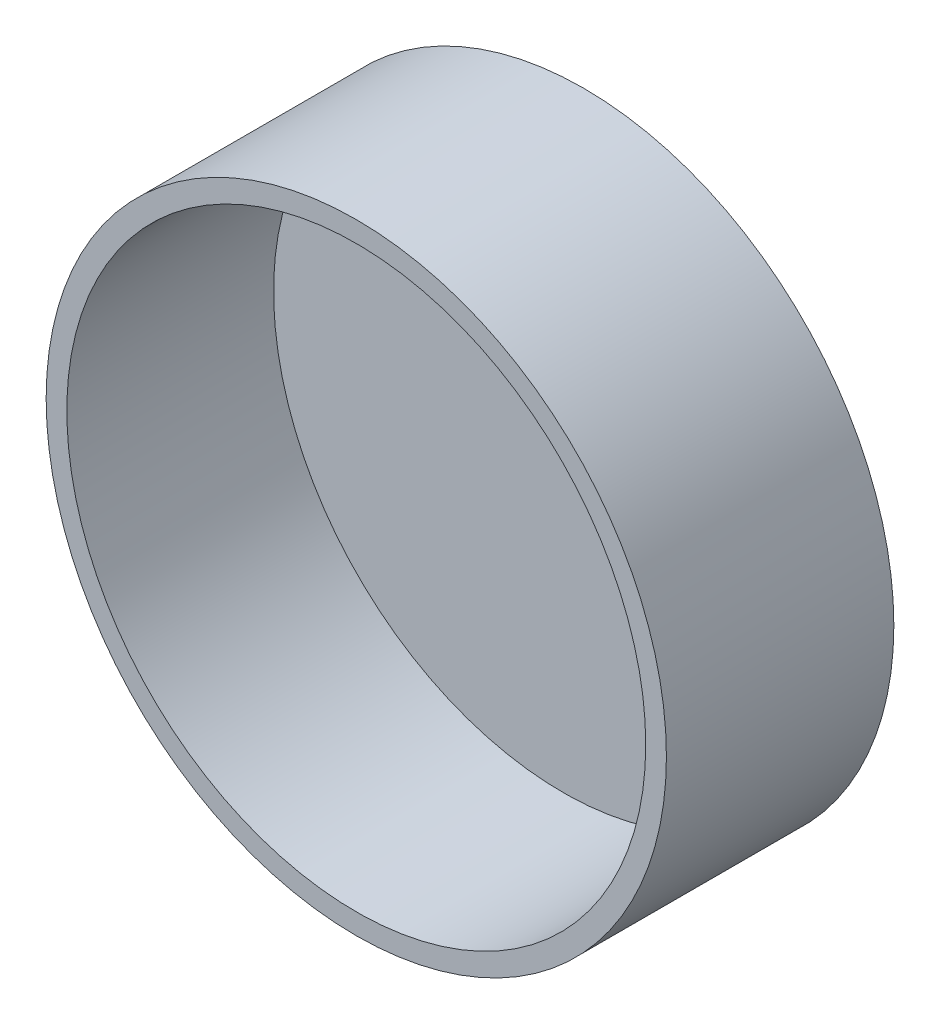
ISO-10303-21;
HEADER;
FILE_DESCRIPTION(('STEP AP214'),'2;1');
FILE_NAME('part.step','',(''),(''),'','','');
FILE_SCHEMA(('AUTOMOTIVE_DESIGN { 1 0 10303 214 1 1 1 1 }'));
ENDSEC;
DATA;
#1=APPLICATION_CONTEXT('core data for automotive mechanical design processes');
#2=APPLICATION_PROTOCOL_DEFINITION('international standard','automotive_design',2000,#1);
#3=PRODUCT_CONTEXT('',#1,'mechanical');
#4=PRODUCT('Part','Part','',(#3));
#5=PRODUCT_RELATED_PRODUCT_CATEGORY('part','',(#4));
#6=PRODUCT_DEFINITION_FORMATION('','',#4);
#7=PRODUCT_DEFINITION_CONTEXT('part definition',#1,'design');
#8=PRODUCT_DEFINITION('design','',#6,#7);
#9=PRODUCT_DEFINITION_SHAPE('','',#8);
#10=(LENGTH_UNIT() NAMED_UNIT(*) SI_UNIT(.MILLI.,.METRE.));
#11=(NAMED_UNIT(*) PLANE_ANGLE_UNIT() SI_UNIT($,.RADIAN.));
#12=(NAMED_UNIT(*) SI_UNIT($,.STERADIAN.) SOLID_ANGLE_UNIT());
#13=UNCERTAINTY_MEASURE_WITH_UNIT(LENGTH_MEASURE(1.E-05),#10,'distance_accuracy_value','');
#14=(GEOMETRIC_REPRESENTATION_CONTEXT(3) GLOBAL_UNCERTAINTY_ASSIGNED_CONTEXT((#13)) GLOBAL_UNIT_ASSIGNED_CONTEXT((#10,
#11,#12)) REPRESENTATION_CONTEXT('',''));
#15=CARTESIAN_POINT('',(0.,0.,0.));
#16=DIRECTION('',(0.,0.,1.));
#17=DIRECTION('',(1.,0.,0.));
#18=AXIS2_PLACEMENT_3D('',#15,#16,#17);
#19=CARTESIAN_POINT('',(0.,0.,11.));
#20=DIRECTION('',(0.,0.,-1.));
#21=DIRECTION('',(-1.,0.,0.));
#22=AXIS2_PLACEMENT_3D('',#19,#20,#21);
#23=CYLINDRICAL_SURFACE('',#22,15.);
#24=CARTESIAN_POINT('',(0.,0.,11.));
#25=DIRECTION('',(0.,0.,1.));
#26=DIRECTION('',(1.,0.,0.));
#27=AXIS2_PLACEMENT_3D('',#24,#25,#26);
#28=CIRCLE('',#27,15.);
#29=CARTESIAN_POINT('',(15.,0.,11.));
#30=VERTEX_POINT('',#29);
#31=EDGE_CURVE('E10',#30,#30,#28,.T.);
#32=ORIENTED_EDGE('',*,*,#31,.F.);
#33=EDGE_LOOP('',(#32));
#34=FACE_BOUND('',#33,.T.);
#35=CARTESIAN_POINT('',(0.,0.,0.));
#36=DIRECTION('',(0.,0.,1.));
#37=DIRECTION('',(1.,0.,0.));
#38=AXIS2_PLACEMENT_3D('',#35,#36,#37);
#39=CIRCLE('',#38,15.);
#40=CARTESIAN_POINT('',(15.,0.,0.));
#41=VERTEX_POINT('',#40);
#42=EDGE_CURVE('E40',#41,#41,#39,.T.);
#43=ORIENTED_EDGE('',*,*,#42,.T.);
#44=EDGE_LOOP('',(#43));
#45=FACE_BOUND('',#44,.T.);
#46=ADVANCED_FACE('F37',(#34,#45),#23,.T.);
#47=CARTESIAN_POINT('',(0.,0.,11.));
#48=DIRECTION('',(0.,0.,1.));
#49=DIRECTION('',(1.,0.,0.));
#50=AXIS2_PLACEMENT_3D('',#47,#48,#49);
#51=PLANE('',#50);
#52=CARTESIAN_POINT('',(0.,0.,11.));
#53=DIRECTION('',(0.,0.,1.));
#54=DIRECTION('',(1.,0.,0.));
#55=AXIS2_PLACEMENT_3D('',#52,#53,#54);
#56=CIRCLE('',#55,14.);
#57=CARTESIAN_POINT('',(14.,0.,11.));
#58=VERTEX_POINT('',#57);
#59=EDGE_CURVE('E51',#58,#58,#56,.T.);
#60=ORIENTED_EDGE('',*,*,#59,.F.);
#61=EDGE_LOOP('',(#60));
#62=FACE_BOUND('',#61,.T.);
#63=ORIENTED_EDGE('',*,*,#31,.T.);
#64=EDGE_LOOP('',(#63));
#65=FACE_BOUND('',#64,.T.);
#66=ADVANCED_FACE('F68',(#62,#65),#51,.T.);
#67=CARTESIAN_POINT('',(0.,0.,0.));
#68=DIRECTION('',(0.,0.,1.));
#69=DIRECTION('',(1.,0.,0.));
#70=AXIS2_PLACEMENT_3D('',#67,#68,#69);
#71=PLANE('',#70);
#72=ORIENTED_EDGE('',*,*,#42,.F.);
#73=EDGE_LOOP('',(#72));
#74=FACE_BOUND('',#73,.T.);
#75=ADVANCED_FACE('F64',(#74),#71,.F.);
#76=CARTESIAN_POINT('',(0.,0.,0.999999999999999));
#77=DIRECTION('',(0.,0.,1.));
#78=DIRECTION('',(1.,0.,0.));
#79=AXIS2_PLACEMENT_3D('',#76,#77,#78);
#80=CYLINDRICAL_SURFACE('',#79,14.);
#81=CARTESIAN_POINT('',(0.,0.,0.999999999999999));
#82=DIRECTION('',(0.,0.,1.));
#83=DIRECTION('',(1.,0.,0.));
#84=AXIS2_PLACEMENT_3D('',#81,#82,#83);
#85=CIRCLE('',#84,14.);
#86=CARTESIAN_POINT('',(14.,0.,0.999999999999999));
#87=VERTEX_POINT('',#86);
#88=EDGE_CURVE('E49',#87,#87,#85,.T.);
#89=ORIENTED_EDGE('',*,*,#88,.F.);
#90=EDGE_LOOP('',(#89));
#91=FACE_BOUND('',#90,.T.);
#92=ORIENTED_EDGE('',*,*,#59,.T.);
#93=EDGE_LOOP('',(#92));
#94=FACE_BOUND('',#93,.T.);
#95=ADVANCED_FACE('F61',(#91,#94),#80,.F.);
#96=CARTESIAN_POINT('',(0.,0.,0.999999999999999));
#97=DIRECTION('',(0.,0.,1.));
#98=DIRECTION('',(1.,0.,0.));
#99=AXIS2_PLACEMENT_3D('',#96,#97,#98);
#100=PLANE('',#99);
#101=ORIENTED_EDGE('',*,*,#88,.T.);
#102=EDGE_LOOP('',(#101));
#103=FACE_BOUND('',#102,.T.);
#104=ADVANCED_FACE('F59',(#103),#100,.T.);
#105=CLOSED_SHELL('',(#46,#66,#75,#95,#104));
#106=MANIFOLD_SOLID_BREP('B2',#105);
#107=ADVANCED_BREP_SHAPE_REPRESENTATION('',(#18,#106),#14);
#108=SHAPE_DEFINITION_REPRESENTATION(#9,#107);
ENDSEC;
END-ISO-10303-21;
